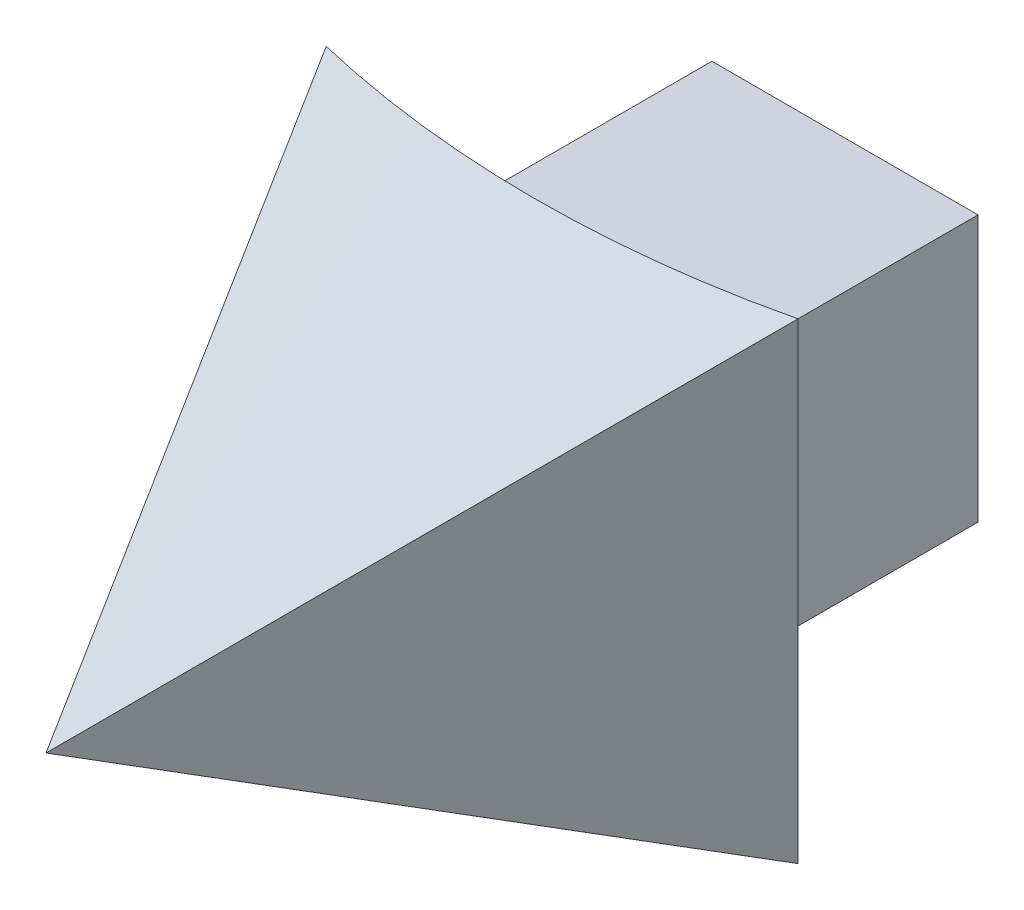
ISO-10303-21;
HEADER;
FILE_DESCRIPTION(('STEP AP214'),'2;1');
FILE_NAME('part.step','',(''),(''),'','','');
FILE_SCHEMA(('AUTOMOTIVE_DESIGN { 1 0 10303 214 1 1 1 1 }'));
ENDSEC;
DATA;
#1=APPLICATION_CONTEXT('core data for automotive mechanical design processes');
#2=APPLICATION_PROTOCOL_DEFINITION('international standard','automotive_design',2000,#1);
#3=PRODUCT_CONTEXT('',#1,'mechanical');
#4=PRODUCT('Part','Part','',(#3));
#5=PRODUCT_RELATED_PRODUCT_CATEGORY('part','',(#4));
#6=PRODUCT_DEFINITION_FORMATION('','',#4);
#7=PRODUCT_DEFINITION_CONTEXT('part definition',#1,'design');
#8=PRODUCT_DEFINITION('design','',#6,#7);
#9=PRODUCT_DEFINITION_SHAPE('','',#8);
#10=(LENGTH_UNIT() NAMED_UNIT(*) SI_UNIT(.MILLI.,.METRE.));
#11=(NAMED_UNIT(*) PLANE_ANGLE_UNIT() SI_UNIT($,.RADIAN.));
#12=(NAMED_UNIT(*) SI_UNIT($,.STERADIAN.) SOLID_ANGLE_UNIT());
#13=UNCERTAINTY_MEASURE_WITH_UNIT(LENGTH_MEASURE(1.E-05),#10,'distance_accuracy_value','');
#14=(GEOMETRIC_REPRESENTATION_CONTEXT(3) GLOBAL_UNCERTAINTY_ASSIGNED_CONTEXT((#13)) GLOBAL_UNIT_ASSIGNED_CONTEXT((#10,
#11,#12)) REPRESENTATION_CONTEXT('',''));
#15=CARTESIAN_POINT('',(0.,0.,0.));
#16=DIRECTION('',(0.,0.,1.));
#17=DIRECTION('',(1.,0.,0.));
#18=AXIS2_PLACEMENT_3D('',#15,#16,#17);
#19=CARTESIAN_POINT('',(-9.525,31.75,40.1217683634458));
#20=CARTESIAN_POINT('',(0.,41.275,60.96));
#21=CARTESIAN_POINT('',(-8.74567706897372,31.75,40.3067814179748));
#22=CARTESIAN_POINT('',(0.,41.275,60.96));
#23=CARTESIAN_POINT('',(-7.17624752548362,31.75,40.6313833641646));
#24=CARTESIAN_POINT('',(0.,41.275,60.96));
#25=CARTESIAN_POINT('',(-4.79774165931796,31.7499999999999,40.9803540739042));
#26=CARTESIAN_POINT('',(0.,41.275,60.96));
#27=CARTESIAN_POINT('',(-2.40294943624431,31.75,41.1902133599667));
#28=CARTESIAN_POINT('',(0.,41.275,60.96));
#29=CARTESIAN_POINT('',(-0.800983184074137,31.75,41.2369));
#30=CARTESIAN_POINT('',(0.,41.275,60.96));
#31=CARTESIAN_POINT('',(0.800983184074137,31.75,41.2369));
#32=CARTESIAN_POINT('',(0.,41.275,60.96));
#33=CARTESIAN_POINT('',(2.40294943624431,31.75,41.1902133599667));
#34=CARTESIAN_POINT('',(0.,41.275,60.96));
#35=CARTESIAN_POINT('',(4.79774165931796,31.75,40.9803540739042));
#36=CARTESIAN_POINT('',(0.,41.275,60.96));
#37=CARTESIAN_POINT('',(7.17624752548363,31.75,40.6313833641646));
#38=CARTESIAN_POINT('',(0.,41.275,60.96));
#39=CARTESIAN_POINT('',(8.74567706897373,31.75,40.3067814179748));
#40=CARTESIAN_POINT('',(0.,41.275,60.96));
#41=CARTESIAN_POINT('',(9.52500000000001,31.75,40.1217683634458));
#42=CARTESIAN_POINT('',(0.,41.275,60.96));
#43=B_SPLINE_SURFACE_WITH_KNOTS('',3,1,((#19,#20),(#21,#22),(#23,#24),(#25,#26),(#27,#28),(#29,
#30),(#31,#32),(#33,#34),(#35,#36),(#37,#38),(#39,#40),(#41,#42)),.UNSPECIFIED.,.F.,.F.,.F.,(4,
1,1,1,2,1,1,1,4),(2,2),(0.,0.125,0.25,0.375,0.5,0.625,0.75,0.875,1.),(0.,1.),.UNSPECIFIED.);
#44=CARTESIAN_POINT('',(0.,31.75,0.));
#45=DIRECTION('',(0.,-1.,0.));
#46=DIRECTION('',(0.,0.,1.));
#47=AXIS2_PLACEMENT_3D('',#44,#45,#46);
#48=CIRCLE('',#47,41.2369);
#49=CARTESIAN_POINT('',(0.,31.75,41.2369));
#50=VERTEX_POINT('',#49);
#51=CARTESIAN_POINT('',(-9.525,31.75,40.1217683634458));
#52=VERTEX_POINT('',#51);
#53=EDGE_CURVE('E231',#50,#52,#48,.T.);
#54=CARTESIAN_POINT('',(0.,31.75,0.));
#55=DIRECTION('',(0.,-1.,0.));
#56=DIRECTION('',(0.,0.,1.));
#57=AXIS2_PLACEMENT_3D('',#54,#55,#56);
#58=CIRCLE('',#57,41.2369);
#59=CARTESIAN_POINT('',(9.52500000000001,31.75,40.1217683634458));
#60=VERTEX_POINT('',#59);
#61=EDGE_CURVE('E260',#60,#50,#58,.T.);
#62=DIRECTION('',(-0.38387192552333,0.38387192552333,0.839812294259867));
#63=VECTOR('',#62,1.);
#64=CARTESIAN_POINT('',(4.7625,36.5125,50.5408841817229));
#65=LINE('',#64,#63);
#66=CARTESIAN_POINT('',(0.,41.275,60.96));
#67=VERTEX_POINT('',#66);
#68=EDGE_CURVE('E161',#60,#67,#65,.T.);
#69=DIRECTION('',(0.38387192552333,0.38387192552333,0.839812294259867));
#70=VECTOR('',#69,1.);
#71=CARTESIAN_POINT('',(-4.7625,36.5125,50.5408841817229));
#72=LINE('',#71,#70);
#73=EDGE_CURVE('E263',#52,#67,#72,.T.);
#74=ORIENTED_EDGE('',*,*,#53,.F.);
#75=ORIENTED_EDGE('',*,*,#61,.F.);
#76=ORIENTED_EDGE('',*,*,#68,.T.);
#77=ORIENTED_EDGE('',*,*,#73,.F.);
#78=EDGE_LOOP('',(#74,#75,#76,#77));
#79=FACE_BOUND('',#78,.T.);
#80=ADVANCED_FACE('F70',(#79),#43,.T.);
#81=CARTESIAN_POINT('',(9.525,31.75,40.1217683634458));
#82=DIRECTION('',(0.909491782606579,0.,0.415721899075701));
#83=DIRECTION('',(0.,1.,0.));
#84=AXIS2_PLACEMENT_3D('',#81,#82,#83);
#85=PLANE('',#84);
#86=DIRECTION('',(0.,-1.,0.));
#87=VECTOR('',#86,1.);
#88=CARTESIAN_POINT('',(9.525,50.8,40.1217683634458));
#89=LINE('',#88,#87);
#90=CARTESIAN_POINT('',(9.52499999999999,50.8,40.1217683634458));
#91=VERTEX_POINT('',#90);
#92=EDGE_CURVE('E314',#91,#60,#89,.T.);
#93=ORIENTED_EDGE('',*,*,#92,.F.);
#94=DIRECTION('',(0.38387192552333,0.38387192552333,-0.839812294259867));
#95=VECTOR('',#94,1.);
#96=CARTESIAN_POINT('',(4.7625,46.0375,50.5408841817229));
#97=LINE('',#96,#95);
#98=EDGE_CURVE('E277',#67,#91,#97,.T.);
#99=ORIENTED_EDGE('',*,*,#98,.F.);
#100=ORIENTED_EDGE('',*,*,#68,.F.);
#101=EDGE_LOOP('',(#93,#99,#100));
#102=FACE_BOUND('',#101,.T.);
#103=ADVANCED_FACE('F249',(#102),#85,.T.);
#104=CARTESIAN_POINT('',(-9.525,50.8,40.1217683634458));
#105=DIRECTION('',(-0.909491782606579,0.,0.415721899075701));
#106=DIRECTION('',(0.,-1.,0.));
#107=AXIS2_PLACEMENT_3D('',#104,#105,#106);
#108=PLANE('',#107);
#109=DIRECTION('',(0.,1.,0.));
#110=VECTOR('',#109,1.);
#111=CARTESIAN_POINT('',(-9.525,50.8,40.1217683634458));
#112=LINE('',#111,#110);
#113=CARTESIAN_POINT('',(-9.52500000000001,50.8,40.1217683634458));
#114=VERTEX_POINT('',#113);
#115=EDGE_CURVE('E96',#52,#114,#112,.T.);
#116=ORIENTED_EDGE('',*,*,#115,.F.);
#117=ORIENTED_EDGE('',*,*,#73,.T.);
#118=DIRECTION('',(0.383871925523331,-0.38387192552333,0.839812294259867));
#119=VECTOR('',#118,1.);
#120=CARTESIAN_POINT('',(-4.7625,46.0375,50.5408841817229));
#121=LINE('',#120,#119);
#122=EDGE_CURVE('E285',#114,#67,#121,.T.);
#123=ORIENTED_EDGE('',*,*,#122,.F.);
#124=EDGE_LOOP('',(#116,#117,#123));
#125=FACE_BOUND('',#124,.T.);
#126=ADVANCED_FACE('F254',(#125),#108,.T.);
#127=CARTESIAN_POINT('',(9.52499999999999,50.8,40.1217683634458));
#128=CARTESIAN_POINT('',(0.,41.275,60.96));
#129=CARTESIAN_POINT('',(8.74567706897371,50.8,40.3067814179748));
#130=CARTESIAN_POINT('',(0.,41.275,60.96));
#131=CARTESIAN_POINT('',(7.17624752548362,50.8000000000001,40.6313833641646));
#132=CARTESIAN_POINT('',(0.,41.275,60.96));
#133=CARTESIAN_POINT('',(4.79774165931795,50.7999999999999,40.9803540739042));
#134=CARTESIAN_POINT('',(0.,41.275,60.96));
#135=CARTESIAN_POINT('',(2.4029494362443,50.8000000000001,41.1902133599667));
#136=CARTESIAN_POINT('',(0.,41.275,60.96));
#137=CARTESIAN_POINT('',(0.800983184074129,50.8,41.2369));
#138=CARTESIAN_POINT('',(0.,41.275,60.96));
#139=CARTESIAN_POINT('',(-0.800983184074144,50.8,41.2369));
#140=CARTESIAN_POINT('',(0.,41.275,60.96));
#141=CARTESIAN_POINT('',(-2.40294943624432,50.8000000000001,41.1902133599666));
#142=CARTESIAN_POINT('',(0.,41.275,60.96));
#143=CARTESIAN_POINT('',(-4.79774165931797,50.7999999999999,40.9803540739043));
#144=CARTESIAN_POINT('',(0.,41.275,60.96));
#145=CARTESIAN_POINT('',(-7.17624752548362,50.8,40.6313833641646));
#146=CARTESIAN_POINT('',(0.,41.275,60.96));
#147=CARTESIAN_POINT('',(-8.74567706897372,50.8,40.3067814179748));
#148=CARTESIAN_POINT('',(0.,41.275,60.96));
#149=CARTESIAN_POINT('',(-9.52500000000001,50.8,40.1217683634458));
#150=CARTESIAN_POINT('',(0.,41.275,60.96));
#151=B_SPLINE_SURFACE_WITH_KNOTS('',3,1,((#127,#128),(#129,#130),(#131,#132),(#133,#134),(#135,
#136),(#137,#138),(#139,#140),(#141,#142),(#143,#144),(#145,#146),(#147,#148),(#149,#150)),
.UNSPECIFIED.,.F.,.F.,.F.,(4,1,1,1,2,1,1,1,4),(2,2),(0.,0.125,0.25,0.375,0.5,0.625,0.75,0.875,
1.),(0.,1.),.UNSPECIFIED.);
#152=CARTESIAN_POINT('',(9.52499999999999,50.8,40.1217683634458));
#153=CARTESIAN_POINT('',(8.74567706897371,50.8,40.3067814179748));
#154=CARTESIAN_POINT('',(7.17624752548362,50.8000000000001,40.6313833641646));
#155=CARTESIAN_POINT('',(4.79774165931795,50.7999999999999,40.9803540739042));
#156=CARTESIAN_POINT('',(2.4029494362443,50.8000000000001,41.1902133599667));
#157=CARTESIAN_POINT('',(0.800983184074129,50.8,41.2369));
#158=CARTESIAN_POINT('',(-0.800983184074144,50.8,41.2369));
#159=CARTESIAN_POINT('',(-2.40294943624432,50.8000000000001,41.1902133599666));
#160=CARTESIAN_POINT('',(-4.79774165931797,50.7999999999999,40.9803540739043));
#161=CARTESIAN_POINT('',(-7.17624752548362,50.8,40.6313833641646));
#162=CARTESIAN_POINT('',(-8.74567706897372,50.8,40.3067814179748));
#163=CARTESIAN_POINT('',(-9.52500000000001,50.8,40.1217683634458));
#164=B_SPLINE_CURVE_WITH_KNOTS('',3,(#152,#153,#154,#155,#156,#157,#158,#159,#160,#161,#162,
#163),.UNSPECIFIED.,.F.,.F.,(4,1,1,1,2,1,1,1,4),(0.,0.125,0.25,0.375,0.5,0.625,0.75,0.875,1.),.UNSPECIFIED.);
#165=CARTESIAN_POINT('',(0.,50.8,41.2369));
#166=VERTEX_POINT('',#165);
#167=EDGE_CURVE('E219',#166,#91,#164,.F.);
#168=CARTESIAN_POINT('',(0.,50.8,0.));
#169=DIRECTION('',(0.,1.,0.));
#170=DIRECTION('',(1.,0.,0.));
#171=AXIS2_PLACEMENT_3D('',#168,#169,#170);
#172=CIRCLE('',#171,41.2369);
#173=EDGE_CURVE('E211',#114,#166,#172,.T.);
#174=ORIENTED_EDGE('',*,*,#167,.F.);
#175=ORIENTED_EDGE('',*,*,#173,.F.);
#176=ORIENTED_EDGE('',*,*,#122,.T.);
#177=ORIENTED_EDGE('',*,*,#98,.T.);
#178=EDGE_LOOP('',(#174,#175,#176,#177));
#179=FACE_BOUND('',#178,.T.);
#180=ADVANCED_FACE('F181',(#179),#151,.T.);
#181=CARTESIAN_POINT('',(0.,0.,0.));
#182=DIRECTION('',(0.,1.,0.));
#183=DIRECTION('',(0.,0.,1.));
#184=AXIS2_PLACEMENT_3D('',#181,#182,#183);
#185=CYLINDRICAL_SURFACE('',#184,41.2369);
#186=CARTESIAN_POINT('',(0.,46.6471,0.));
#187=DIRECTION('',(0.,1.,0.));
#188=DIRECTION('',(0.,0.,1.));
#189=AXIS2_PLACEMENT_3D('',#186,#187,#188);
#190=CIRCLE('',#189,41.2369);
#191=CARTESIAN_POINT('',(5.37210000000001,46.6471,40.8854798577686));
#192=VERTEX_POINT('',#191);
#193=CARTESIAN_POINT('',(-5.37210000000001,46.6471,40.8854798577686));
#194=VERTEX_POINT('',#193);
#195=EDGE_CURVE('E80',#192,#194,#190,.F.);
#196=ORIENTED_EDGE('',*,*,#195,.T.);
#197=DIRECTION('',(0.,1.,0.));
#198=VECTOR('',#197,1.);
#199=CARTESIAN_POINT('',(-5.37210000000001,0.,40.8854798577686));
#200=LINE('',#199,#198);
#201=CARTESIAN_POINT('',(-5.37210000000001,35.9029,40.8854798577686));
#202=VERTEX_POINT('',#201);
#203=EDGE_CURVE('E12',#194,#202,#200,.F.);
#204=ORIENTED_EDGE('',*,*,#203,.T.);
#205=CARTESIAN_POINT('',(0.,35.9029,0.));
#206=DIRECTION('',(0.,-1.,0.));
#207=DIRECTION('',(0.,0.,-1.));
#208=AXIS2_PLACEMENT_3D('',#205,#206,#207);
#209=CIRCLE('',#208,41.2369);
#210=CARTESIAN_POINT('',(5.37210000000001,35.9029,40.8854798577686));
#211=VERTEX_POINT('',#210);
#212=EDGE_CURVE('E138',#202,#211,#209,.F.);
#213=ORIENTED_EDGE('',*,*,#212,.T.);
#214=DIRECTION('',(0.,1.,0.));
#215=VECTOR('',#214,1.);
#216=CARTESIAN_POINT('',(5.37210000000001,0.,40.8854798577686));
#217=LINE('',#216,#215);
#218=EDGE_CURVE('E234',#211,#192,#217,.T.);
#219=ORIENTED_EDGE('',*,*,#218,.T.);
#220=EDGE_LOOP('',(#196,#204,#213,#219));
#221=FACE_BOUND('',#220,.T.);
#222=ORIENTED_EDGE('',*,*,#92,.T.);
#223=ORIENTED_EDGE('',*,*,#61,.T.);
#224=ORIENTED_EDGE('',*,*,#53,.T.);
#225=ORIENTED_EDGE('',*,*,#115,.T.);
#226=ORIENTED_EDGE('',*,*,#173,.T.);
#227=ORIENTED_EDGE('',*,*,#167,.T.);
#228=EDGE_LOOP('',(#222,#223,#224,#225,#226,#227));
#229=FACE_BOUND('',#228,.T.);
#230=ADVANCED_FACE('F171',(#221,#229),#185,.F.);
#231=CARTESIAN_POINT('',(-5.37210000000001,35.9029,28.702));
#232=DIRECTION('',(-1.,0.,0.));
#233=DIRECTION('',(0.,0.,1.));
#234=AXIS2_PLACEMENT_3D('',#231,#232,#233);
#235=PLANE('',#234);
#236=ORIENTED_EDGE('',*,*,#203,.F.);
#237=DIRECTION('',(0.,0.,1.));
#238=VECTOR('',#237,1.);
#239=CARTESIAN_POINT('',(-5.37210000000001,46.6471,28.702));
#240=LINE('',#239,#238);
#241=CARTESIAN_POINT('',(-5.37210000000001,46.6471,28.702));
#242=VERTEX_POINT('',#241);
#243=EDGE_CURVE('E155',#242,#194,#240,.T.);
#244=ORIENTED_EDGE('',*,*,#243,.F.);
#245=DIRECTION('',(0.,-1.,0.));
#246=VECTOR('',#245,1.);
#247=CARTESIAN_POINT('',(-5.37210000000001,35.9029,28.702));
#248=LINE('',#247,#246);
#249=CARTESIAN_POINT('',(-5.37210000000001,35.9029,28.702));
#250=VERTEX_POINT('',#249);
#251=EDGE_CURVE('E148',#242,#250,#248,.T.);
#252=ORIENTED_EDGE('',*,*,#251,.T.);
#253=DIRECTION('',(0.,0.,1.));
#254=VECTOR('',#253,1.);
#255=CARTESIAN_POINT('',(-5.37210000000001,35.9029,28.702));
#256=LINE('',#255,#254);
#257=EDGE_CURVE('E133',#250,#202,#256,.T.);
#258=ORIENTED_EDGE('',*,*,#257,.T.);
#259=EDGE_LOOP('',(#236,#244,#252,#258));
#260=FACE_BOUND('',#259,.T.);
#261=ADVANCED_FACE('F153',(#260),#235,.T.);
#262=CARTESIAN_POINT('',(5.37210000000001,46.6471,28.702));
#263=DIRECTION('',(0.,1.,0.));
#264=DIRECTION('',(0.,0.,1.));
#265=AXIS2_PLACEMENT_3D('',#262,#263,#264);
#266=PLANE('',#265);
#267=ORIENTED_EDGE('',*,*,#195,.F.);
#268=DIRECTION('',(0.,0.,1.));
#269=VECTOR('',#268,1.);
#270=CARTESIAN_POINT('',(5.37210000000001,46.6471,28.702));
#271=LINE('',#270,#269);
#272=CARTESIAN_POINT('',(5.37210000000001,46.6471,28.702));
#273=VERTEX_POINT('',#272);
#274=EDGE_CURVE('E162',#273,#192,#271,.T.);
#275=ORIENTED_EDGE('',*,*,#274,.F.);
#276=DIRECTION('',(-1.,0.,0.));
#277=VECTOR('',#276,1.);
#278=CARTESIAN_POINT('',(5.37210000000001,46.6471,28.702));
#279=LINE('',#278,#277);
#280=EDGE_CURVE('E141',#273,#242,#279,.T.);
#281=ORIENTED_EDGE('',*,*,#280,.T.);
#282=ORIENTED_EDGE('',*,*,#243,.T.);
#283=EDGE_LOOP('',(#267,#275,#281,#282));
#284=FACE_BOUND('',#283,.T.);
#285=ADVANCED_FACE('F238',(#284),#266,.T.);
#286=CARTESIAN_POINT('',(5.37210000000001,35.9029,28.702));
#287=DIRECTION('',(1.,0.,0.));
#288=DIRECTION('',(0.,0.,-1.));
#289=AXIS2_PLACEMENT_3D('',#286,#287,#288);
#290=PLANE('',#289);
#291=ORIENTED_EDGE('',*,*,#218,.F.);
#292=DIRECTION('',(0.,0.,1.));
#293=VECTOR('',#292,1.);
#294=CARTESIAN_POINT('',(5.37210000000001,35.9029,28.702));
#295=LINE('',#294,#293);
#296=CARTESIAN_POINT('',(5.37210000000001,35.9029,28.702));
#297=VERTEX_POINT('',#296);
#298=EDGE_CURVE('E87',#297,#211,#295,.T.);
#299=ORIENTED_EDGE('',*,*,#298,.F.);
#300=DIRECTION('',(0.,1.,0.));
#301=VECTOR('',#300,1.);
#302=CARTESIAN_POINT('',(5.37210000000001,35.9029,28.702));
#303=LINE('',#302,#301);
#304=EDGE_CURVE('E151',#297,#273,#303,.T.);
#305=ORIENTED_EDGE('',*,*,#304,.T.);
#306=ORIENTED_EDGE('',*,*,#274,.T.);
#307=EDGE_LOOP('',(#291,#299,#305,#306));
#308=FACE_BOUND('',#307,.T.);
#309=ADVANCED_FACE('F240',(#308),#290,.T.);
#310=CARTESIAN_POINT('',(5.37210000000001,35.9029,28.702));
#311=DIRECTION('',(0.,-1.,0.));
#312=DIRECTION('',(0.,0.,-1.));
#313=AXIS2_PLACEMENT_3D('',#310,#311,#312);
#314=PLANE('',#313);
#315=ORIENTED_EDGE('',*,*,#212,.F.);
#316=ORIENTED_EDGE('',*,*,#257,.F.);
#317=DIRECTION('',(1.,0.,0.));
#318=VECTOR('',#317,1.);
#319=CARTESIAN_POINT('',(5.37210000000001,35.9029,28.702));
#320=LINE('',#319,#318);
#321=EDGE_CURVE('E136',#250,#297,#320,.T.);
#322=ORIENTED_EDGE('',*,*,#321,.T.);
#323=ORIENTED_EDGE('',*,*,#298,.T.);
#324=EDGE_LOOP('',(#315,#316,#322,#323));
#325=FACE_BOUND('',#324,.T.);
#326=ADVANCED_FACE('F135',(#325),#314,.T.);
#327=CARTESIAN_POINT('',(0.,0.,28.702));
#328=DIRECTION('',(0.,0.,1.));
#329=DIRECTION('',(1.,0.,0.));
#330=AXIS2_PLACEMENT_3D('',#327,#328,#329);
#331=PLANE('',#330);
#332=ORIENTED_EDGE('',*,*,#251,.F.);
#333=ORIENTED_EDGE('',*,*,#280,.F.);
#334=ORIENTED_EDGE('',*,*,#304,.F.);
#335=ORIENTED_EDGE('',*,*,#321,.F.);
#336=EDGE_LOOP('',(#332,#333,#334,#335));
#337=FACE_BOUND('',#336,.T.);
#338=ADVANCED_FACE('F146',(#337),#331,.F.);
#339=CLOSED_SHELL('',(#80,#103,#126,#180,#230,#261,#285,#309,#326,#338));
#340=MANIFOLD_SOLID_BREP('B2',#339);
#341=ADVANCED_BREP_SHAPE_REPRESENTATION('',(#18,#340),#14);
#342=SHAPE_DEFINITION_REPRESENTATION(#9,#341);
ENDSEC;
END-ISO-10303-21;
